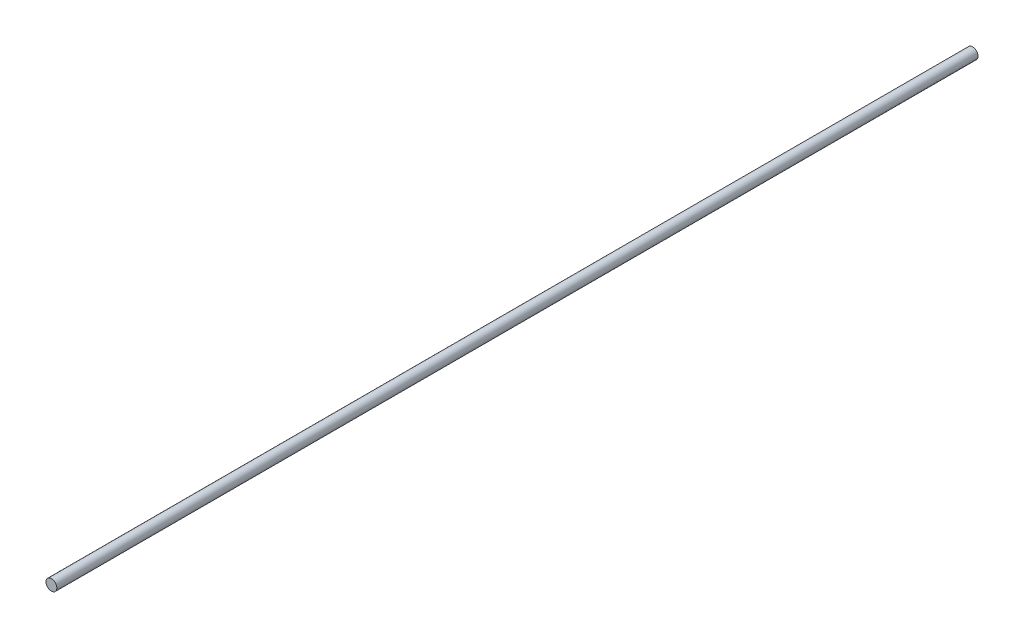
ISO-10303-21;
HEADER;
FILE_DESCRIPTION(('STEP AP214'),'2;1');
FILE_NAME('part.step','',(''),(''),'','','');
FILE_SCHEMA(('AUTOMOTIVE_DESIGN { 1 0 10303 214 1 1 1 1 }'));
ENDSEC;
DATA;
#1=APPLICATION_CONTEXT('core data for automotive mechanical design processes');
#2=APPLICATION_PROTOCOL_DEFINITION('international standard','automotive_design',2000,#1);
#3=PRODUCT_CONTEXT('',#1,'mechanical');
#4=PRODUCT('Part','Part','',(#3));
#5=PRODUCT_RELATED_PRODUCT_CATEGORY('part','',(#4));
#6=PRODUCT_DEFINITION_FORMATION('','',#4);
#7=PRODUCT_DEFINITION_CONTEXT('part definition',#1,'design');
#8=PRODUCT_DEFINITION('design','',#6,#7);
#9=PRODUCT_DEFINITION_SHAPE('','',#8);
#10=(LENGTH_UNIT() NAMED_UNIT(*) SI_UNIT(.MILLI.,.METRE.));
#11=(NAMED_UNIT(*) PLANE_ANGLE_UNIT() SI_UNIT($,.RADIAN.));
#12=(NAMED_UNIT(*) SI_UNIT($,.STERADIAN.) SOLID_ANGLE_UNIT());
#13=UNCERTAINTY_MEASURE_WITH_UNIT(LENGTH_MEASURE(1.E-05),#10,'distance_accuracy_value','');
#14=(GEOMETRIC_REPRESENTATION_CONTEXT(3) GLOBAL_UNCERTAINTY_ASSIGNED_CONTEXT((#13)) GLOBAL_UNIT_ASSIGNED_CONTEXT((#10,
#11,#12)) REPRESENTATION_CONTEXT('',''));
#15=CARTESIAN_POINT('',(0.,0.,0.));
#16=DIRECTION('',(0.,0.,1.));
#17=DIRECTION('',(1.,0.,0.));
#18=AXIS2_PLACEMENT_3D('',#15,#16,#17);
#19=CARTESIAN_POINT('',(0.,0.,680.));
#20=DIRECTION('',(0.,0.,-1.));
#21=DIRECTION('',(-1.,0.,0.));
#22=AXIS2_PLACEMENT_3D('',#19,#20,#21);
#23=CYLINDRICAL_SURFACE('',#22,4.);
#24=CARTESIAN_POINT('',(0.,0.,680.));
#25=DIRECTION('',(0.,0.,1.));
#26=DIRECTION('',(1.,0.,0.));
#27=AXIS2_PLACEMENT_3D('',#24,#25,#26);
#28=CIRCLE('',#27,4.);
#29=CARTESIAN_POINT('',(4.,0.,680.));
#30=VERTEX_POINT('',#29);
#31=EDGE_CURVE('E10',#30,#30,#28,.T.);
#32=ORIENTED_EDGE('',*,*,#31,.F.);
#33=EDGE_LOOP('',(#32));
#34=FACE_BOUND('',#33,.T.);
#35=CARTESIAN_POINT('',(0.,0.,0.));
#36=DIRECTION('',(0.,0.,1.));
#37=DIRECTION('',(1.,0.,0.));
#38=AXIS2_PLACEMENT_3D('',#35,#36,#37);
#39=CIRCLE('',#38,4.);
#40=CARTESIAN_POINT('',(4.,0.,0.));
#41=VERTEX_POINT('',#40);
#42=EDGE_CURVE('E34',#41,#41,#39,.T.);
#43=ORIENTED_EDGE('',*,*,#42,.T.);
#44=EDGE_LOOP('',(#43));
#45=FACE_BOUND('',#44,.T.);
#46=ADVANCED_FACE('F31',(#34,#45),#23,.T.);
#47=CARTESIAN_POINT('',(0.,0.,680.));
#48=DIRECTION('',(0.,0.,1.));
#49=DIRECTION('',(1.,0.,0.));
#50=AXIS2_PLACEMENT_3D('',#47,#48,#49);
#51=PLANE('',#50);
#52=ORIENTED_EDGE('',*,*,#31,.T.);
#53=EDGE_LOOP('',(#52));
#54=FACE_BOUND('',#53,.T.);
#55=ADVANCED_FACE('F46',(#54),#51,.T.);
#56=CARTESIAN_POINT('',(0.,0.,0.));
#57=DIRECTION('',(0.,0.,1.));
#58=DIRECTION('',(1.,0.,0.));
#59=AXIS2_PLACEMENT_3D('',#56,#57,#58);
#60=PLANE('',#59);
#61=ORIENTED_EDGE('',*,*,#42,.F.);
#62=EDGE_LOOP('',(#61));
#63=FACE_BOUND('',#62,.T.);
#64=ADVANCED_FACE('F44',(#63),#60,.F.);
#65=CLOSED_SHELL('',(#46,#55,#64));
#66=MANIFOLD_SOLID_BREP('B2',#65);
#67=ADVANCED_BREP_SHAPE_REPRESENTATION('',(#18,#66),#14);
#68=SHAPE_DEFINITION_REPRESENTATION(#9,#67);
ENDSEC;
END-ISO-10303-21;
